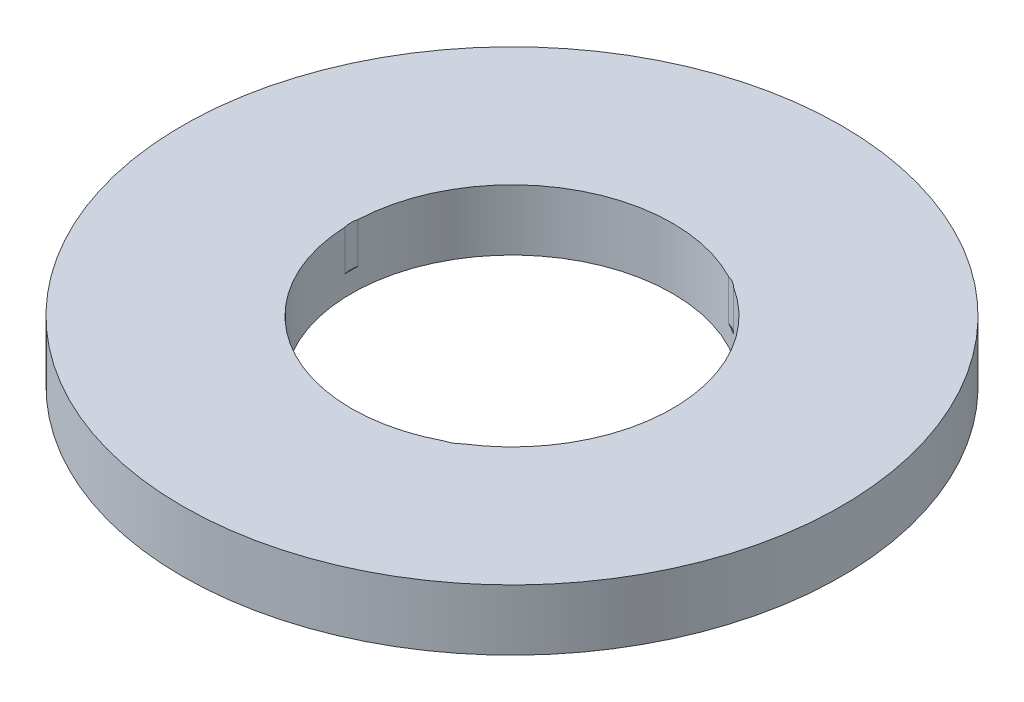
ISO-10303-21;
HEADER;
FILE_DESCRIPTION(('STEP AP214'),'2;1');
FILE_NAME('part.step','',(''),(''),'','','');
FILE_SCHEMA(('AUTOMOTIVE_DESIGN { 1 0 10303 214 1 1 1 1 }'));
ENDSEC;
DATA;
#1=APPLICATION_CONTEXT('core data for automotive mechanical design processes');
#2=APPLICATION_PROTOCOL_DEFINITION('international standard','automotive_design',2000,#1);
#3=PRODUCT_CONTEXT('',#1,'mechanical');
#4=PRODUCT('Part','Part','',(#3));
#5=PRODUCT_RELATED_PRODUCT_CATEGORY('part','',(#4));
#6=PRODUCT_DEFINITION_FORMATION('','',#4);
#7=PRODUCT_DEFINITION_CONTEXT('part definition',#1,'design');
#8=PRODUCT_DEFINITION('design','',#6,#7);
#9=PRODUCT_DEFINITION_SHAPE('','',#8);
#10=(LENGTH_UNIT() NAMED_UNIT(*) SI_UNIT(.MILLI.,.METRE.));
#11=(NAMED_UNIT(*) PLANE_ANGLE_UNIT() SI_UNIT($,.RADIAN.));
#12=(NAMED_UNIT(*) SI_UNIT($,.STERADIAN.) SOLID_ANGLE_UNIT());
#13=UNCERTAINTY_MEASURE_WITH_UNIT(LENGTH_MEASURE(1.E-05),#10,'distance_accuracy_value','');
#14=(GEOMETRIC_REPRESENTATION_CONTEXT(3) GLOBAL_UNCERTAINTY_ASSIGNED_CONTEXT((#13)) GLOBAL_UNIT_ASSIGNED_CONTEXT((#10,
#11,#12)) REPRESENTATION_CONTEXT('',''));
#15=CARTESIAN_POINT('',(0.,0.,0.));
#16=DIRECTION('',(0.,0.,1.));
#17=DIRECTION('',(1.,0.,0.));
#18=AXIS2_PLACEMENT_3D('',#15,#16,#17);
#19=CARTESIAN_POINT('',(0.,18.,0.));
#20=DIRECTION('',(0.,-1.,0.));
#21=DIRECTION('',(0.,0.,-1.));
#22=AXIS2_PLACEMENT_3D('',#19,#20,#21);
#23=CYLINDRICAL_SURFACE('',#22,97.5);
#24=CARTESIAN_POINT('',(0.,18.,0.));
#25=DIRECTION('',(0.,1.,0.));
#26=DIRECTION('',(0.,0.,1.));
#27=AXIS2_PLACEMENT_3D('',#24,#25,#26);
#28=CIRCLE('',#27,97.5);
#29=CARTESIAN_POINT('',(0.,18.,97.5));
#30=VERTEX_POINT('',#29);
#31=EDGE_CURVE('E130',#30,#30,#28,.T.);
#32=ORIENTED_EDGE('',*,*,#31,.F.);
#33=EDGE_LOOP('',(#32));
#34=FACE_BOUND('',#33,.T.);
#35=CARTESIAN_POINT('',(0.,0.,0.));
#36=DIRECTION('',(0.,1.,0.));
#37=DIRECTION('',(0.,0.,1.));
#38=AXIS2_PLACEMENT_3D('',#35,#36,#37);
#39=CIRCLE('',#38,97.5);
#40=CARTESIAN_POINT('',(0.,0.,97.5));
#41=VERTEX_POINT('',#40);
#42=EDGE_CURVE('E117',#41,#41,#39,.T.);
#43=ORIENTED_EDGE('',*,*,#42,.T.);
#44=EDGE_LOOP('',(#43));
#45=FACE_BOUND('',#44,.T.);
#46=ADVANCED_FACE('F39',(#34,#45),#23,.T.);
#47=CARTESIAN_POINT('',(0.,18.,0.));
#48=DIRECTION('',(0.,1.,0.));
#49=DIRECTION('',(0.,0.,1.));
#50=AXIS2_PLACEMENT_3D('',#47,#48,#49);
#51=PLANE('',#50);
#52=CARTESIAN_POINT('',(20.1384143268046,18.,34.8807567978981));
#53=DIRECTION('',(0.,1.,0.));
#54=DIRECTION('',(0.866025403784436,0.,-0.500000000000004));
#55=AXIS2_PLACEMENT_3D('',#52,#53,#54);
#56=CIRCLE('',#55,7.44502037765011);
#57=CARTESIAN_POINT('',(22.0336114960872,18.,42.0805176351182));
#58=VERTEX_POINT('',#57);
#59=CARTESIAN_POINT('',(25.4259915283682,18.,40.1219261102872));
#60=VERTEX_POINT('',#59);
#61=EDGE_CURVE('E148',#58,#60,#56,.T.);
#62=ORIENTED_EDGE('',*,*,#61,.F.);
#63=CARTESIAN_POINT('',(0.,18.,0.));
#64=DIRECTION('',(0.,1.,0.));
#65=DIRECTION('',(0.,0.,1.));
#66=AXIS2_PLACEMENT_3D('',#63,#64,#65);
#67=CIRCLE('',#66,47.5);
#68=CARTESIAN_POINT('',(-47.459603024455,18.,1.95859152483091));
#69=VERTEX_POINT('',#68);
#70=EDGE_CURVE('E113',#69,#58,#67,.T.);
#71=ORIENTED_EDGE('',*,*,#70,.F.);
#72=CARTESIAN_POINT('',(-40.2768286536088,18.,0.));
#73=DIRECTION('',(0.,1.,0.));
#74=DIRECTION('',(0.,0.,1.));
#75=AXIS2_PLACEMENT_3D('',#72,#73,#74);
#76=CIRCLE('',#75,7.44502037765011);
#77=CARTESIAN_POINT('',(-47.459603024455,18.,-1.95859152483091));
#78=VERTEX_POINT('',#77);
#79=EDGE_CURVE('E125',#78,#69,#76,.T.);
#80=ORIENTED_EDGE('',*,*,#79,.F.);
#81=CARTESIAN_POINT('',(22.0336114960867,18.,-42.0805176351185));
#82=VERTEX_POINT('',#81);
#83=EDGE_CURVE('E107',#82,#78,#67,.T.);
#84=ORIENTED_EDGE('',*,*,#83,.F.);
#85=CARTESIAN_POINT('',(20.1384143268041,18.,-34.8807567978984));
#86=DIRECTION('',(0.,1.,0.));
#87=DIRECTION('',(-0.866025403784443,0.,-0.499999999999992));
#88=AXIS2_PLACEMENT_3D('',#85,#86,#87);
#89=CIRCLE('',#88,7.44502037765011);
#90=CARTESIAN_POINT('',(25.4259915283676,18.,-40.1219261102876));
#91=VERTEX_POINT('',#90);
#92=EDGE_CURVE('E95',#91,#82,#89,.T.);
#93=ORIENTED_EDGE('',*,*,#92,.F.);
#94=EDGE_CURVE('E106',#60,#91,#67,.T.);
#95=ORIENTED_EDGE('',*,*,#94,.F.);
#96=EDGE_LOOP('',(#62,#71,#80,#84,#93,#95));
#97=FACE_BOUND('',#96,.T.);
#98=ORIENTED_EDGE('',*,*,#31,.T.);
#99=EDGE_LOOP('',(#98));
#100=FACE_BOUND('',#99,.T.);
#101=ADVANCED_FACE('F102',(#97,#100),#51,.T.);
#102=CARTESIAN_POINT('',(0.,0.,0.));
#103=DIRECTION('',(0.,1.,0.));
#104=DIRECTION('',(0.,0.,1.));
#105=AXIS2_PLACEMENT_3D('',#102,#103,#104);
#106=PLANE('',#105);
#107=CARTESIAN_POINT('',(0.,0.,0.));
#108=DIRECTION('',(0.,1.,0.));
#109=DIRECTION('',(0.,0.,1.));
#110=AXIS2_PLACEMENT_3D('',#107,#108,#109);
#111=CIRCLE('',#110,47.5);
#112=CARTESIAN_POINT('',(0.,0.,47.5));
#113=VERTEX_POINT('',#112);
#114=EDGE_CURVE('E118',#113,#113,#111,.T.);
#115=ORIENTED_EDGE('',*,*,#114,.T.);
#116=EDGE_LOOP('',(#115));
#117=FACE_BOUND('',#116,.T.);
#118=ORIENTED_EDGE('',*,*,#42,.F.);
#119=EDGE_LOOP('',(#118));
#120=FACE_BOUND('',#119,.T.);
#121=ADVANCED_FACE('F161',(#117,#120),#106,.F.);
#122=CARTESIAN_POINT('',(0.,18.,0.));
#123=DIRECTION('',(0.,-1.,0.));
#124=DIRECTION('',(0.,0.,-1.));
#125=AXIS2_PLACEMENT_3D('',#122,#123,#124);
#126=CYLINDRICAL_SURFACE('',#125,47.5);
#127=DIRECTION('',(0.,1.,0.));
#128=VECTOR('',#127,1.);
#129=CARTESIAN_POINT('',(22.033611496087,11.9966867509887,42.0805176351183));
#130=LINE('',#129,#128);
#131=CARTESIAN_POINT('',(22.0336114960872,5.99337350197748,42.0805176351182));
#132=VERTEX_POINT('',#131);
#133=EDGE_CURVE('E11',#132,#58,#130,.T.);
#134=ORIENTED_EDGE('',*,*,#133,.F.);
#135=CARTESIAN_POINT('',(0.,5.99337350197748,0.));
#136=DIRECTION('',(0.,1.,0.));
#137=DIRECTION('',(0.,0.,1.));
#138=AXIS2_PLACEMENT_3D('',#135,#136,#137);
#139=CIRCLE('',#138,47.5);
#140=CARTESIAN_POINT('',(25.4259915283682,5.99337350197748,40.1219261102872));
#141=VERTEX_POINT('',#140);
#142=EDGE_CURVE('E100',#132,#141,#139,.T.);
#143=ORIENTED_EDGE('',*,*,#142,.T.);
#144=DIRECTION('',(0.,1.,0.));
#145=VECTOR('',#144,1.);
#146=CARTESIAN_POINT('',(25.4259915283684,11.9966867509887,40.1219261102871));
#147=LINE('',#146,#145);
#148=EDGE_CURVE('E46',#60,#141,#147,.F.);
#149=ORIENTED_EDGE('',*,*,#148,.F.);
#150=ORIENTED_EDGE('',*,*,#94,.T.);
#151=DIRECTION('',(0.,1.,0.));
#152=VECTOR('',#151,1.);
#153=CARTESIAN_POINT('',(25.4259915283676,11.9966867509887,-40.1219261102876));
#154=LINE('',#153,#152);
#155=CARTESIAN_POINT('',(25.4259915283676,5.99337350197748,-40.1219261102876));
#156=VERTEX_POINT('',#155);
#157=EDGE_CURVE('E90',#156,#91,#154,.T.);
#158=ORIENTED_EDGE('',*,*,#157,.F.);
#159=CARTESIAN_POINT('',(0.,5.99337350197748,0.));
#160=DIRECTION('',(0.,1.,0.));
#161=DIRECTION('',(0.,0.,1.));
#162=AXIS2_PLACEMENT_3D('',#159,#160,#161);
#163=CIRCLE('',#162,47.5);
#164=CARTESIAN_POINT('',(22.0336114960867,5.99337350197748,-42.0805176351185));
#165=VERTEX_POINT('',#164);
#166=EDGE_CURVE('E143',#156,#165,#163,.T.);
#167=ORIENTED_EDGE('',*,*,#166,.T.);
#168=DIRECTION('',(0.,1.,0.));
#169=VECTOR('',#168,1.);
#170=CARTESIAN_POINT('',(22.0336114960866,11.9966867509887,-42.0805176351185));
#171=LINE('',#170,#169);
#172=EDGE_CURVE('E98',#82,#165,#171,.F.);
#173=ORIENTED_EDGE('',*,*,#172,.F.);
#174=ORIENTED_EDGE('',*,*,#83,.T.);
#175=DIRECTION('',(0.,1.,0.));
#176=VECTOR('',#175,1.);
#177=CARTESIAN_POINT('',(-47.459603024455,11.9966867509887,-1.95859152483095));
#178=LINE('',#177,#176);
#179=CARTESIAN_POINT('',(-47.459603024455,5.99337350197748,-1.95859152483091));
#180=VERTEX_POINT('',#179);
#181=EDGE_CURVE('E137',#180,#78,#178,.T.);
#182=ORIENTED_EDGE('',*,*,#181,.F.);
#183=CARTESIAN_POINT('',(0.,5.99337350197748,0.));
#184=DIRECTION('',(0.,1.,0.));
#185=DIRECTION('',(0.,0.,1.));
#186=AXIS2_PLACEMENT_3D('',#183,#184,#185);
#187=CIRCLE('',#186,47.5);
#188=CARTESIAN_POINT('',(-47.459603024455,5.99337350197748,1.95859152483091));
#189=VERTEX_POINT('',#188);
#190=EDGE_CURVE('E128',#180,#189,#187,.T.);
#191=ORIENTED_EDGE('',*,*,#190,.T.);
#192=DIRECTION('',(0.,1.,0.));
#193=VECTOR('',#192,1.);
#194=CARTESIAN_POINT('',(-47.459603024455,11.9966867509887,1.95859152483095));
#195=LINE('',#194,#193);
#196=EDGE_CURVE('E134',#69,#189,#195,.F.);
#197=ORIENTED_EDGE('',*,*,#196,.F.);
#198=ORIENTED_EDGE('',*,*,#70,.T.);
#199=EDGE_LOOP('',(#134,#143,#149,#150,#158,#167,#173,#174,#182,#191,#197,#198));
#200=FACE_BOUND('',#199,.T.);
#201=ORIENTED_EDGE('',*,*,#114,.F.);
#202=EDGE_LOOP('',(#201));
#203=FACE_BOUND('',#202,.T.);
#204=ADVANCED_FACE('F115',(#200,#203),#126,.F.);
#205=CARTESIAN_POINT('',(-40.2768286536088,5.99337350197748,0.));
#206=DIRECTION('',(0.,1.,0.));
#207=DIRECTION('',(0.,0.,1.));
#208=AXIS2_PLACEMENT_3D('',#205,#206,#207);
#209=CYLINDRICAL_SURFACE('',#208,7.44502037765011);
#210=ORIENTED_EDGE('',*,*,#181,.T.);
#211=ORIENTED_EDGE('',*,*,#79,.T.);
#212=ORIENTED_EDGE('',*,*,#196,.T.);
#213=CARTESIAN_POINT('',(-40.2768286536088,5.99337350197748,0.));
#214=DIRECTION('',(0.,1.,0.));
#215=DIRECTION('',(0.,0.,1.));
#216=AXIS2_PLACEMENT_3D('',#213,#214,#215);
#217=CIRCLE('',#216,7.44502037765011);
#218=EDGE_CURVE('E127',#180,#189,#217,.T.);
#219=ORIENTED_EDGE('',*,*,#218,.F.);
#220=EDGE_LOOP('',(#210,#211,#212,#219));
#221=FACE_BOUND('',#220,.T.);
#222=ADVANCED_FACE('F175',(#221),#209,.F.);
#223=CARTESIAN_POINT('',(-40.2768286536088,5.99337350197748,0.));
#224=DIRECTION('',(0.,1.,0.));
#225=DIRECTION('',(0.,0.,1.));
#226=AXIS2_PLACEMENT_3D('',#223,#224,#225);
#227=PLANE('',#226);
#228=ORIENTED_EDGE('',*,*,#218,.T.);
#229=ORIENTED_EDGE('',*,*,#190,.F.);
#230=EDGE_LOOP('',(#228,#229));
#231=FACE_BOUND('',#230,.T.);
#232=ADVANCED_FACE('F176',(#231),#227,.T.);
#233=CARTESIAN_POINT('',(20.1384143268041,5.99337350197748,-34.8807567978984));
#234=DIRECTION('',(0.,1.,0.));
#235=DIRECTION('',(0.,0.,1.));
#236=AXIS2_PLACEMENT_3D('',#233,#234,#235);
#237=CYLINDRICAL_SURFACE('',#236,7.44502037765011);
#238=ORIENTED_EDGE('',*,*,#157,.T.);
#239=ORIENTED_EDGE('',*,*,#92,.T.);
#240=ORIENTED_EDGE('',*,*,#172,.T.);
#241=CARTESIAN_POINT('',(20.1384143268041,5.99337350197748,-34.8807567978984));
#242=DIRECTION('',(0.,1.,0.));
#243=DIRECTION('',(-0.866025403784443,0.,-0.499999999999992));
#244=AXIS2_PLACEMENT_3D('',#241,#242,#243);
#245=CIRCLE('',#244,7.44502037765011);
#246=EDGE_CURVE('E56',#156,#165,#245,.T.);
#247=ORIENTED_EDGE('',*,*,#246,.F.);
#248=EDGE_LOOP('',(#238,#239,#240,#247));
#249=FACE_BOUND('',#248,.T.);
#250=ADVANCED_FACE('F93',(#249),#237,.F.);
#251=CARTESIAN_POINT('',(20.1384143268041,5.99337350197748,-34.8807567978984));
#252=DIRECTION('',(0.,1.,0.));
#253=DIRECTION('',(-0.866025403784443,0.,-0.499999999999992));
#254=AXIS2_PLACEMENT_3D('',#251,#252,#253);
#255=PLANE('',#254);
#256=ORIENTED_EDGE('',*,*,#246,.T.);
#257=ORIENTED_EDGE('',*,*,#166,.F.);
#258=EDGE_LOOP('',(#256,#257));
#259=FACE_BOUND('',#258,.T.);
#260=ADVANCED_FACE('F153',(#259),#255,.T.);
#261=CARTESIAN_POINT('',(20.1384143268046,5.99337350197748,34.8807567978981));
#262=DIRECTION('',(0.,1.,0.));
#263=DIRECTION('',(0.,0.,1.));
#264=AXIS2_PLACEMENT_3D('',#261,#262,#263);
#265=CYLINDRICAL_SURFACE('',#264,7.44502037765011);
#266=ORIENTED_EDGE('',*,*,#133,.T.);
#267=ORIENTED_EDGE('',*,*,#61,.T.);
#268=ORIENTED_EDGE('',*,*,#148,.T.);
#269=CARTESIAN_POINT('',(20.1384143268046,5.99337350197748,34.8807567978981));
#270=DIRECTION('',(0.,1.,0.));
#271=DIRECTION('',(0.866025403784436,0.,-0.500000000000004));
#272=AXIS2_PLACEMENT_3D('',#269,#270,#271);
#273=CIRCLE('',#272,7.44502037765011);
#274=EDGE_CURVE('E55',#132,#141,#273,.T.);
#275=ORIENTED_EDGE('',*,*,#274,.F.);
#276=EDGE_LOOP('',(#266,#267,#268,#275));
#277=FACE_BOUND('',#276,.T.);
#278=ADVANCED_FACE('F144',(#277),#265,.F.);
#279=CARTESIAN_POINT('',(20.1384143268046,5.99337350197748,34.8807567978981));
#280=DIRECTION('',(0.,1.,0.));
#281=DIRECTION('',(0.866025403784436,0.,-0.500000000000004));
#282=AXIS2_PLACEMENT_3D('',#279,#280,#281);
#283=PLANE('',#282);
#284=ORIENTED_EDGE('',*,*,#274,.T.);
#285=ORIENTED_EDGE('',*,*,#142,.F.);
#286=EDGE_LOOP('',(#284,#285));
#287=FACE_BOUND('',#286,.T.);
#288=ADVANCED_FACE('F150',(#287),#283,.T.);
#289=CLOSED_SHELL('',(#46,#101,#121,#204,#222,#232,#250,#260,#278,#288));
#290=MANIFOLD_SOLID_BREP('B2',#289);
#291=ADVANCED_BREP_SHAPE_REPRESENTATION('',(#18,#290),#14);
#292=SHAPE_DEFINITION_REPRESENTATION(#9,#291);
ENDSEC;
END-ISO-10303-21;
